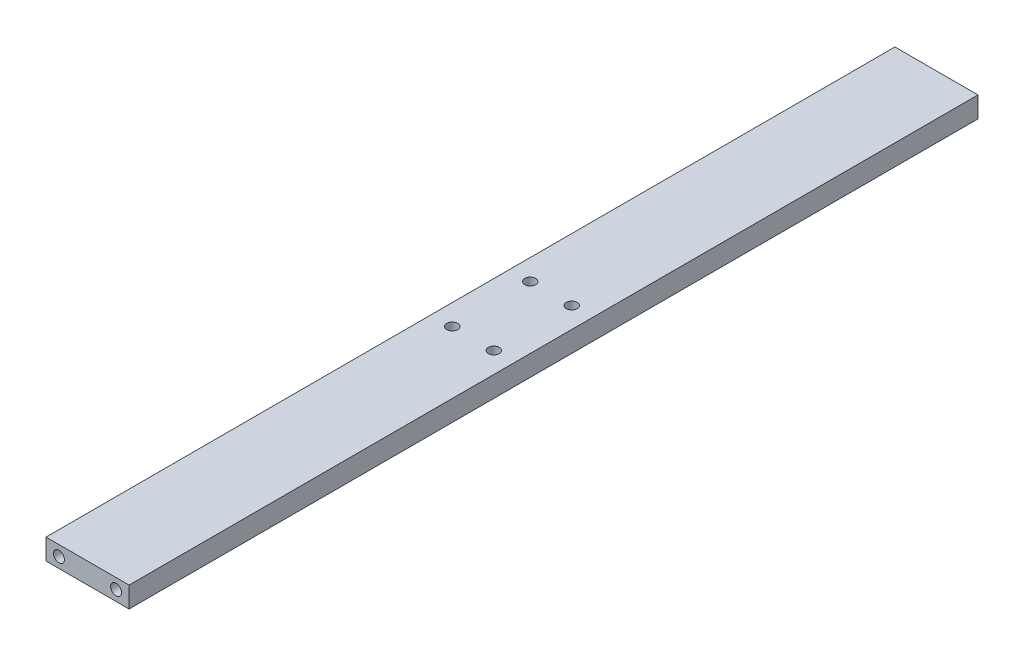
ISO-10303-21;
HEADER;
FILE_DESCRIPTION(('STEP AP214'),'2;1');
FILE_NAME('part.step','',(''),(''),'','','');
FILE_SCHEMA(('AUTOMOTIVE_DESIGN { 1 0 10303 214 1 1 1 1 }'));
ENDSEC;
DATA;
#1=APPLICATION_CONTEXT('core data for automotive mechanical design processes');
#2=APPLICATION_PROTOCOL_DEFINITION('international standard','automotive_design',2000,#1);
#3=PRODUCT_CONTEXT('',#1,'mechanical');
#4=PRODUCT('Part','Part','',(#3));
#5=PRODUCT_RELATED_PRODUCT_CATEGORY('part','',(#4));
#6=PRODUCT_DEFINITION_FORMATION('','',#4);
#7=PRODUCT_DEFINITION_CONTEXT('part definition',#1,'design');
#8=PRODUCT_DEFINITION('design','',#6,#7);
#9=PRODUCT_DEFINITION_SHAPE('','',#8);
#10=(LENGTH_UNIT() NAMED_UNIT(*) SI_UNIT(.MILLI.,.METRE.));
#11=(NAMED_UNIT(*) PLANE_ANGLE_UNIT() SI_UNIT($,.RADIAN.));
#12=(NAMED_UNIT(*) SI_UNIT($,.STERADIAN.) SOLID_ANGLE_UNIT());
#13=UNCERTAINTY_MEASURE_WITH_UNIT(LENGTH_MEASURE(1.E-05),#10,'distance_accuracy_value','');
#14=(GEOMETRIC_REPRESENTATION_CONTEXT(3) GLOBAL_UNCERTAINTY_ASSIGNED_CONTEXT((#13)) GLOBAL_UNIT_ASSIGNED_CONTEXT((#10,
#11,#12)) REPRESENTATION_CONTEXT('',''));
#15=CARTESIAN_POINT('',(0.,0.,0.));
#16=DIRECTION('',(0.,0.,1.));
#17=DIRECTION('',(1.,0.,0.));
#18=AXIS2_PLACEMENT_3D('',#15,#16,#17);
#19=CARTESIAN_POINT('',(-16.,-4.,163.5));
#20=DIRECTION('',(1.,0.,0.));
#21=DIRECTION('',(0.,0.,-1.));
#22=AXIS2_PLACEMENT_3D('',#19,#20,#21);
#23=PLANE('',#22);
#24=DIRECTION('',(0.,-1.,0.));
#25=VECTOR('',#24,1.);
#26=CARTESIAN_POINT('',(-16.,-4.,-163.5));
#27=LINE('',#26,#25);
#28=CARTESIAN_POINT('',(-16.,4.,-163.5));
#29=VERTEX_POINT('',#28);
#30=CARTESIAN_POINT('',(-16.,-4.,-163.5));
#31=VERTEX_POINT('',#30);
#32=EDGE_CURVE('E97',#29,#31,#27,.T.);
#33=ORIENTED_EDGE('',*,*,#32,.T.);
#34=DIRECTION('',(0.,0.,-1.));
#35=VECTOR('',#34,1.);
#36=CARTESIAN_POINT('',(-16.,-4.,163.5));
#37=LINE('',#36,#35);
#38=CARTESIAN_POINT('',(-16.,-4.,163.5));
#39=VERTEX_POINT('',#38);
#40=EDGE_CURVE('E11',#39,#31,#37,.T.);
#41=ORIENTED_EDGE('',*,*,#40,.F.);
#42=DIRECTION('',(0.,-1.,0.));
#43=VECTOR('',#42,1.);
#44=CARTESIAN_POINT('',(-16.,-4.,163.5));
#45=LINE('',#44,#43);
#46=CARTESIAN_POINT('',(-16.,4.,163.5));
#47=VERTEX_POINT('',#46);
#48=EDGE_CURVE('E85',#47,#39,#45,.T.);
#49=ORIENTED_EDGE('',*,*,#48,.F.);
#50=DIRECTION('',(0.,0.,-1.));
#51=VECTOR('',#50,1.);
#52=CARTESIAN_POINT('',(-16.,4.,163.5));
#53=LINE('',#52,#51);
#54=EDGE_CURVE('E93',#47,#29,#53,.T.);
#55=ORIENTED_EDGE('',*,*,#54,.T.);
#56=EDGE_LOOP('',(#33,#41,#49,#55));
#57=FACE_BOUND('',#56,.T.);
#58=ADVANCED_FACE('F34',(#57),#23,.F.);
#59=CARTESIAN_POINT('',(16.,-4.,163.5));
#60=DIRECTION('',(0.,1.,0.));
#61=DIRECTION('',(-1.,0.,0.));
#62=AXIS2_PLACEMENT_3D('',#59,#60,#61);
#63=PLANE('',#62);
#64=CARTESIAN_POINT('',(-7.99999999999912,-4.,-15.0000000000006));
#65=DIRECTION('',(0.,1.,0.));
#66=DIRECTION('',(-1.,0.,0.));
#67=AXIS2_PLACEMENT_3D('',#64,#65,#66);
#68=CIRCLE('',#67,2.10000000000043);
#69=CARTESIAN_POINT('',(-10.0999999999996,-4.,-15.0000000000006));
#70=VERTEX_POINT('',#69);
#71=EDGE_CURVE('E140',#70,#70,#68,.F.);
#72=ORIENTED_EDGE('',*,*,#71,.F.);
#73=EDGE_LOOP('',(#72));
#74=FACE_BOUND('',#73,.T.);
#75=CARTESIAN_POINT('',(8.00000000000001,-4.,15.0000000000001));
#76=DIRECTION('',(0.,1.,0.));
#77=DIRECTION('',(-1.,0.,0.));
#78=AXIS2_PLACEMENT_3D('',#75,#76,#77);
#79=CIRCLE('',#78,2.10000000000043);
#80=CARTESIAN_POINT('',(5.89999999999957,-4.,15.0000000000001));
#81=VERTEX_POINT('',#80);
#82=EDGE_CURVE('E141',#81,#81,#79,.F.);
#83=ORIENTED_EDGE('',*,*,#82,.F.);
#84=EDGE_LOOP('',(#83));
#85=FACE_BOUND('',#84,.T.);
#86=CARTESIAN_POINT('',(8.0000000000009,-4.,-15.0000000000006));
#87=DIRECTION('',(0.,1.,0.));
#88=DIRECTION('',(-1.,0.,0.));
#89=AXIS2_PLACEMENT_3D('',#86,#87,#88);
#90=CIRCLE('',#89,2.10000000000043);
#91=CARTESIAN_POINT('',(5.90000000000046,-4.,-15.0000000000006));
#92=VERTEX_POINT('',#91);
#93=EDGE_CURVE('E148',#92,#92,#90,.F.);
#94=ORIENTED_EDGE('',*,*,#93,.F.);
#95=EDGE_LOOP('',(#94));
#96=FACE_BOUND('',#95,.T.);
#97=CARTESIAN_POINT('',(-8.00000000000001,-4.,15.0000000000001));
#98=DIRECTION('',(0.,1.,0.));
#99=DIRECTION('',(-1.,0.,0.));
#100=AXIS2_PLACEMENT_3D('',#97,#98,#99);
#101=CIRCLE('',#100,2.10000000000043);
#102=CARTESIAN_POINT('',(-10.1000000000004,-4.,15.0000000000001));
#103=VERTEX_POINT('',#102);
#104=EDGE_CURVE('E127',#103,#103,#101,.F.);
#105=ORIENTED_EDGE('',*,*,#104,.F.);
#106=EDGE_LOOP('',(#105));
#107=FACE_BOUND('',#106,.T.);
#108=DIRECTION('',(1.,0.,0.));
#109=VECTOR('',#108,1.);
#110=CARTESIAN_POINT('',(16.,-4.,-163.5));
#111=LINE('',#110,#109);
#112=CARTESIAN_POINT('',(16.,-4.,-163.5));
#113=VERTEX_POINT('',#112);
#114=EDGE_CURVE('E89',#31,#113,#111,.T.);
#115=ORIENTED_EDGE('',*,*,#114,.T.);
#116=DIRECTION('',(0.,0.,-1.));
#117=VECTOR('',#116,1.);
#118=CARTESIAN_POINT('',(16.,-4.,163.5));
#119=LINE('',#118,#117);
#120=CARTESIAN_POINT('',(16.,-4.,163.5));
#121=VERTEX_POINT('',#120);
#122=EDGE_CURVE('E42',#121,#113,#119,.T.);
#123=ORIENTED_EDGE('',*,*,#122,.F.);
#124=DIRECTION('',(1.,0.,0.));
#125=VECTOR('',#124,1.);
#126=CARTESIAN_POINT('',(16.,-4.,163.5));
#127=LINE('',#126,#125);
#128=EDGE_CURVE('E80',#39,#121,#127,.T.);
#129=ORIENTED_EDGE('',*,*,#128,.F.);
#130=ORIENTED_EDGE('',*,*,#40,.T.);
#131=EDGE_LOOP('',(#115,#123,#129,#130));
#132=FACE_BOUND('',#131,.T.);
#133=ADVANCED_FACE('F88',(#74,#85,#96,#107,#132),#63,.F.);
#134=CARTESIAN_POINT('',(16.,-4.,163.5));
#135=DIRECTION('',(-1.,0.,0.));
#136=DIRECTION('',(0.,0.,1.));
#137=AXIS2_PLACEMENT_3D('',#134,#135,#136);
#138=PLANE('',#137);
#139=DIRECTION('',(0.,1.,0.));
#140=VECTOR('',#139,1.);
#141=CARTESIAN_POINT('',(16.,-4.,-163.5));
#142=LINE('',#141,#140);
#143=CARTESIAN_POINT('',(16.,4.,-163.5));
#144=VERTEX_POINT('',#143);
#145=EDGE_CURVE('E67',#113,#144,#142,.T.);
#146=ORIENTED_EDGE('',*,*,#145,.T.);
#147=DIRECTION('',(0.,0.,-1.));
#148=VECTOR('',#147,1.);
#149=CARTESIAN_POINT('',(16.,4.,163.5));
#150=LINE('',#149,#148);
#151=CARTESIAN_POINT('',(16.,4.,163.5));
#152=VERTEX_POINT('',#151);
#153=EDGE_CURVE('E90',#152,#144,#150,.T.);
#154=ORIENTED_EDGE('',*,*,#153,.F.);
#155=DIRECTION('',(0.,1.,0.));
#156=VECTOR('',#155,1.);
#157=CARTESIAN_POINT('',(16.,-4.,163.5));
#158=LINE('',#157,#156);
#159=EDGE_CURVE('E83',#121,#152,#158,.T.);
#160=ORIENTED_EDGE('',*,*,#159,.F.);
#161=ORIENTED_EDGE('',*,*,#122,.T.);
#162=EDGE_LOOP('',(#146,#154,#160,#161));
#163=FACE_BOUND('',#162,.T.);
#164=ADVANCED_FACE('F91',(#163),#138,.F.);
#165=CARTESIAN_POINT('',(16.,4.,163.5));
#166=DIRECTION('',(0.,-1.,0.));
#167=DIRECTION('',(1.,0.,0.));
#168=AXIS2_PLACEMENT_3D('',#165,#166,#167);
#169=PLANE('',#168);
#170=CARTESIAN_POINT('',(-7.99999999999912,4.,-15.0000000000006));
#171=DIRECTION('',(0.,1.,0.));
#172=DIRECTION('',(-1.,0.,0.));
#173=AXIS2_PLACEMENT_3D('',#170,#171,#172);
#174=CIRCLE('',#173,2.10000000000043);
#175=CARTESIAN_POINT('',(-10.0999999999996,4.,-15.0000000000006));
#176=VERTEX_POINT('',#175);
#177=EDGE_CURVE('E144',#176,#176,#174,.T.);
#178=ORIENTED_EDGE('',*,*,#177,.F.);
#179=EDGE_LOOP('',(#178));
#180=FACE_BOUND('',#179,.T.);
#181=CARTESIAN_POINT('',(8.00000000000001,4.,15.0000000000001));
#182=DIRECTION('',(0.,1.,0.));
#183=DIRECTION('',(-1.,0.,0.));
#184=AXIS2_PLACEMENT_3D('',#181,#182,#183);
#185=CIRCLE('',#184,2.10000000000043);
#186=CARTESIAN_POINT('',(5.89999999999957,4.,15.0000000000001));
#187=VERTEX_POINT('',#186);
#188=EDGE_CURVE('E145',#187,#187,#185,.T.);
#189=ORIENTED_EDGE('',*,*,#188,.F.);
#190=EDGE_LOOP('',(#189));
#191=FACE_BOUND('',#190,.T.);
#192=CARTESIAN_POINT('',(8.0000000000009,4.,-15.0000000000006));
#193=DIRECTION('',(0.,1.,0.));
#194=DIRECTION('',(-1.,0.,0.));
#195=AXIS2_PLACEMENT_3D('',#192,#193,#194);
#196=CIRCLE('',#195,2.10000000000043);
#197=CARTESIAN_POINT('',(5.90000000000046,4.,-15.0000000000006));
#198=VERTEX_POINT('',#197);
#199=EDGE_CURVE('E155',#198,#198,#196,.T.);
#200=ORIENTED_EDGE('',*,*,#199,.F.);
#201=EDGE_LOOP('',(#200));
#202=FACE_BOUND('',#201,.T.);
#203=CARTESIAN_POINT('',(-8.00000000000001,4.,15.0000000000001));
#204=DIRECTION('',(0.,1.,0.));
#205=DIRECTION('',(-1.,0.,0.));
#206=AXIS2_PLACEMENT_3D('',#203,#204,#205);
#207=CIRCLE('',#206,2.10000000000043);
#208=CARTESIAN_POINT('',(-10.1000000000004,4.,15.0000000000001));
#209=VERTEX_POINT('',#208);
#210=EDGE_CURVE('E137',#209,#209,#207,.T.);
#211=ORIENTED_EDGE('',*,*,#210,.F.);
#212=EDGE_LOOP('',(#211));
#213=FACE_BOUND('',#212,.T.);
#214=DIRECTION('',(-1.,0.,0.));
#215=VECTOR('',#214,1.);
#216=CARTESIAN_POINT('',(16.,4.,-163.5));
#217=LINE('',#216,#215);
#218=EDGE_CURVE('E73',#144,#29,#217,.T.);
#219=ORIENTED_EDGE('',*,*,#218,.T.);
#220=ORIENTED_EDGE('',*,*,#54,.F.);
#221=DIRECTION('',(-1.,0.,0.));
#222=VECTOR('',#221,1.);
#223=CARTESIAN_POINT('',(16.,4.,163.5));
#224=LINE('',#223,#222);
#225=EDGE_CURVE('E50',#152,#47,#224,.T.);
#226=ORIENTED_EDGE('',*,*,#225,.F.);
#227=ORIENTED_EDGE('',*,*,#153,.T.);
#228=EDGE_LOOP('',(#219,#220,#226,#227));
#229=FACE_BOUND('',#228,.T.);
#230=ADVANCED_FACE('F105',(#180,#191,#202,#213,#229),#169,.F.);
#231=CARTESIAN_POINT('',(0.,0.,163.5));
#232=DIRECTION('',(0.,0.,1.));
#233=DIRECTION('',(1.,0.,0.));
#234=AXIS2_PLACEMENT_3D('',#231,#232,#233);
#235=PLANE('',#234);
#236=CARTESIAN_POINT('',(-11.0000000000001,0.,163.5));
#237=DIRECTION('',(0.,0.,1.));
#238=DIRECTION('',(1.,0.,0.));
#239=AXIS2_PLACEMENT_3D('',#236,#237,#238);
#240=CIRCLE('',#239,2.1);
#241=CARTESIAN_POINT('',(-8.90000000000012,0.,163.5));
#242=VERTEX_POINT('',#241);
#243=EDGE_CURVE('E118',#242,#242,#240,.T.);
#244=ORIENTED_EDGE('',*,*,#243,.F.);
#245=EDGE_LOOP('',(#244));
#246=FACE_BOUND('',#245,.T.);
#247=CARTESIAN_POINT('',(11.0000000000001,0.,163.5));
#248=DIRECTION('',(0.,0.,1.));
#249=DIRECTION('',(1.,0.,0.));
#250=AXIS2_PLACEMENT_3D('',#247,#248,#249);
#251=CIRCLE('',#250,2.1);
#252=CARTESIAN_POINT('',(13.1000000000001,0.,163.5));
#253=VERTEX_POINT('',#252);
#254=EDGE_CURVE('E111',#253,#253,#251,.T.);
#255=ORIENTED_EDGE('',*,*,#254,.F.);
#256=EDGE_LOOP('',(#255));
#257=FACE_BOUND('',#256,.T.);
#258=ORIENTED_EDGE('',*,*,#48,.T.);
#259=ORIENTED_EDGE('',*,*,#128,.T.);
#260=ORIENTED_EDGE('',*,*,#159,.T.);
#261=ORIENTED_EDGE('',*,*,#225,.T.);
#262=EDGE_LOOP('',(#258,#259,#260,#261));
#263=FACE_BOUND('',#262,.T.);
#264=ADVANCED_FACE('F81',(#246,#257,#263),#235,.T.);
#265=CARTESIAN_POINT('',(0.,0.,-163.5));
#266=DIRECTION('',(0.,0.,1.));
#267=DIRECTION('',(1.,0.,0.));
#268=AXIS2_PLACEMENT_3D('',#265,#266,#267);
#269=PLANE('',#268);
#270=CARTESIAN_POINT('',(-11.0000000000001,0.,-163.5));
#271=DIRECTION('',(0.,0.,1.));
#272=DIRECTION('',(1.,0.,0.));
#273=AXIS2_PLACEMENT_3D('',#270,#271,#272);
#274=CIRCLE('',#273,2.1);
#275=CARTESIAN_POINT('',(-8.90000000000012,0.,-163.5));
#276=VERTEX_POINT('',#275);
#277=EDGE_CURVE('E130',#276,#276,#274,.T.);
#278=ORIENTED_EDGE('',*,*,#277,.T.);
#279=EDGE_LOOP('',(#278));
#280=FACE_BOUND('',#279,.T.);
#281=CARTESIAN_POINT('',(11.0000000000001,0.,-163.5));
#282=DIRECTION('',(0.,0.,1.));
#283=DIRECTION('',(1.,0.,0.));
#284=AXIS2_PLACEMENT_3D('',#281,#282,#283);
#285=CIRCLE('',#284,2.1);
#286=CARTESIAN_POINT('',(13.1000000000001,0.,-163.5));
#287=VERTEX_POINT('',#286);
#288=EDGE_CURVE('E123',#287,#287,#285,.T.);
#289=ORIENTED_EDGE('',*,*,#288,.T.);
#290=EDGE_LOOP('',(#289));
#291=FACE_BOUND('',#290,.T.);
#292=ORIENTED_EDGE('',*,*,#32,.F.);
#293=ORIENTED_EDGE('',*,*,#218,.F.);
#294=ORIENTED_EDGE('',*,*,#145,.F.);
#295=ORIENTED_EDGE('',*,*,#114,.F.);
#296=EDGE_LOOP('',(#292,#293,#294,#295));
#297=FACE_BOUND('',#296,.T.);
#298=ADVANCED_FACE('F108',(#280,#291,#297),#269,.F.);
#299=CARTESIAN_POINT('',(11.0000000000001,0.,153.5));
#300=DIRECTION('',(0.,0.,1.));
#301=DIRECTION('',(1.,0.,0.));
#302=AXIS2_PLACEMENT_3D('',#299,#300,#301);
#303=CYLINDRICAL_SURFACE('',#302,2.1);
#304=CARTESIAN_POINT('',(11.0000000000001,0.,153.5));
#305=DIRECTION('',(0.,0.,1.));
#306=DIRECTION('',(1.,0.,0.));
#307=AXIS2_PLACEMENT_3D('',#304,#305,#306);
#308=CIRCLE('',#307,2.1);
#309=CARTESIAN_POINT('',(13.1000000000001,0.,153.5));
#310=VERTEX_POINT('',#309);
#311=EDGE_CURVE('E114',#310,#310,#308,.T.);
#312=ORIENTED_EDGE('',*,*,#311,.F.);
#313=EDGE_LOOP('',(#312));
#314=FACE_BOUND('',#313,.T.);
#315=ORIENTED_EDGE('',*,*,#254,.T.);
#316=EDGE_LOOP('',(#315));
#317=FACE_BOUND('',#316,.T.);
#318=ADVANCED_FACE('F187',(#314,#317),#303,.F.);
#319=CARTESIAN_POINT('',(11.0000000000001,0.,153.5));
#320=DIRECTION('',(0.,0.,1.));
#321=DIRECTION('',(1.,0.,0.));
#322=AXIS2_PLACEMENT_3D('',#319,#320,#321);
#323=PLANE('',#322);
#324=ORIENTED_EDGE('',*,*,#311,.T.);
#325=EDGE_LOOP('',(#324));
#326=FACE_BOUND('',#325,.T.);
#327=ADVANCED_FACE('F194',(#326),#323,.T.);
#328=CARTESIAN_POINT('',(-11.0000000000001,0.,153.5));
#329=DIRECTION('',(0.,0.,1.));
#330=DIRECTION('',(1.,0.,0.));
#331=AXIS2_PLACEMENT_3D('',#328,#329,#330);
#332=CYLINDRICAL_SURFACE('',#331,2.1);
#333=CARTESIAN_POINT('',(-11.0000000000001,0.,153.5));
#334=DIRECTION('',(0.,0.,1.));
#335=DIRECTION('',(1.,0.,0.));
#336=AXIS2_PLACEMENT_3D('',#333,#334,#335);
#337=CIRCLE('',#336,2.1);
#338=CARTESIAN_POINT('',(-8.90000000000012,0.,153.5));
#339=VERTEX_POINT('',#338);
#340=EDGE_CURVE('E100',#339,#339,#337,.T.);
#341=ORIENTED_EDGE('',*,*,#340,.F.);
#342=EDGE_LOOP('',(#341));
#343=FACE_BOUND('',#342,.T.);
#344=ORIENTED_EDGE('',*,*,#243,.T.);
#345=EDGE_LOOP('',(#344));
#346=FACE_BOUND('',#345,.T.);
#347=ADVANCED_FACE('F198',(#343,#346),#332,.F.);
#348=CARTESIAN_POINT('',(-11.0000000000001,0.,153.5));
#349=DIRECTION('',(0.,0.,1.));
#350=DIRECTION('',(1.,0.,0.));
#351=AXIS2_PLACEMENT_3D('',#348,#349,#350);
#352=PLANE('',#351);
#353=ORIENTED_EDGE('',*,*,#340,.T.);
#354=EDGE_LOOP('',(#353));
#355=FACE_BOUND('',#354,.T.);
#356=ADVANCED_FACE('F202',(#355),#352,.T.);
#357=CARTESIAN_POINT('',(11.0000000000001,0.,-153.5));
#358=DIRECTION('',(0.,0.,-1.));
#359=DIRECTION('',(-1.,0.,0.));
#360=AXIS2_PLACEMENT_3D('',#357,#358,#359);
#361=CYLINDRICAL_SURFACE('',#360,2.1);
#362=CARTESIAN_POINT('',(11.0000000000001,0.,-153.5));
#363=DIRECTION('',(0.,0.,1.));
#364=DIRECTION('',(1.,0.,0.));
#365=AXIS2_PLACEMENT_3D('',#362,#363,#364);
#366=CIRCLE('',#365,2.1);
#367=CARTESIAN_POINT('',(13.1000000000001,0.,-153.5));
#368=VERTEX_POINT('',#367);
#369=EDGE_CURVE('E126',#368,#368,#366,.T.);
#370=ORIENTED_EDGE('',*,*,#369,.T.);
#371=EDGE_LOOP('',(#370));
#372=FACE_BOUND('',#371,.T.);
#373=ORIENTED_EDGE('',*,*,#288,.F.);
#374=EDGE_LOOP('',(#373));
#375=FACE_BOUND('',#374,.T.);
#376=ADVANCED_FACE('F206',(#372,#375),#361,.F.);
#377=CARTESIAN_POINT('',(11.0000000000001,0.,-153.5));
#378=DIRECTION('',(0.,0.,-1.));
#379=DIRECTION('',(1.,0.,0.));
#380=AXIS2_PLACEMENT_3D('',#377,#378,#379);
#381=PLANE('',#380);
#382=ORIENTED_EDGE('',*,*,#369,.F.);
#383=EDGE_LOOP('',(#382));
#384=FACE_BOUND('',#383,.T.);
#385=ADVANCED_FACE('F210',(#384),#381,.T.);
#386=CARTESIAN_POINT('',(-11.0000000000001,0.,-153.5));
#387=DIRECTION('',(0.,0.,-1.));
#388=DIRECTION('',(-1.,0.,0.));
#389=AXIS2_PLACEMENT_3D('',#386,#387,#388);
#390=CYLINDRICAL_SURFACE('',#389,2.1);
#391=CARTESIAN_POINT('',(-11.0000000000001,0.,-153.5));
#392=DIRECTION('',(0.,0.,1.));
#393=DIRECTION('',(1.,0.,0.));
#394=AXIS2_PLACEMENT_3D('',#391,#392,#393);
#395=CIRCLE('',#394,2.1);
#396=CARTESIAN_POINT('',(-8.90000000000012,0.,-153.5));
#397=VERTEX_POINT('',#396);
#398=EDGE_CURVE('E115',#397,#397,#395,.T.);
#399=ORIENTED_EDGE('',*,*,#398,.T.);
#400=EDGE_LOOP('',(#399));
#401=FACE_BOUND('',#400,.T.);
#402=ORIENTED_EDGE('',*,*,#277,.F.);
#403=EDGE_LOOP('',(#402));
#404=FACE_BOUND('',#403,.T.);
#405=ADVANCED_FACE('F214',(#401,#404),#390,.F.);
#406=CARTESIAN_POINT('',(-11.0000000000001,0.,-153.5));
#407=DIRECTION('',(0.,0.,-1.));
#408=DIRECTION('',(1.,0.,0.));
#409=AXIS2_PLACEMENT_3D('',#406,#407,#408);
#410=PLANE('',#409);
#411=ORIENTED_EDGE('',*,*,#398,.F.);
#412=EDGE_LOOP('',(#411));
#413=FACE_BOUND('',#412,.T.);
#414=ADVANCED_FACE('F171',(#413),#410,.T.);
#415=CARTESIAN_POINT('',(-8.00000000000001,-4.00100000000001,15.0000000000001));
#416=DIRECTION('',(0.,1.,0.));
#417=DIRECTION('',(-1.,0.,0.));
#418=AXIS2_PLACEMENT_3D('',#415,#416,#417);
#419=CYLINDRICAL_SURFACE('',#418,2.10000000000043);
#420=ORIENTED_EDGE('',*,*,#210,.T.);
#421=EDGE_LOOP('',(#420));
#422=FACE_BOUND('',#421,.T.);
#423=ORIENTED_EDGE('',*,*,#104,.T.);
#424=EDGE_LOOP('',(#423));
#425=FACE_BOUND('',#424,.T.);
#426=ADVANCED_FACE('F168',(#422,#425),#419,.F.);
#427=CARTESIAN_POINT('',(8.0000000000009,-4.001,-15.0000000000006));
#428=DIRECTION('',(0.,1.,0.));
#429=DIRECTION('',(-1.,0.,0.));
#430=AXIS2_PLACEMENT_3D('',#427,#428,#429);
#431=CYLINDRICAL_SURFACE('',#430,2.10000000000043);
#432=ORIENTED_EDGE('',*,*,#199,.T.);
#433=EDGE_LOOP('',(#432));
#434=FACE_BOUND('',#433,.T.);
#435=ORIENTED_EDGE('',*,*,#93,.T.);
#436=EDGE_LOOP('',(#435));
#437=FACE_BOUND('',#436,.T.);
#438=ADVANCED_FACE('F159',(#434,#437),#431,.F.);
#439=CARTESIAN_POINT('',(8.00000000000001,-4.001,15.0000000000001));
#440=DIRECTION('',(0.,1.,0.));
#441=DIRECTION('',(-1.,0.,0.));
#442=AXIS2_PLACEMENT_3D('',#439,#440,#441);
#443=CYLINDRICAL_SURFACE('',#442,2.10000000000043);
#444=ORIENTED_EDGE('',*,*,#188,.T.);
#445=EDGE_LOOP('',(#444));
#446=FACE_BOUND('',#445,.T.);
#447=ORIENTED_EDGE('',*,*,#82,.T.);
#448=EDGE_LOOP('',(#447));
#449=FACE_BOUND('',#448,.T.);
#450=ADVANCED_FACE('F222',(#446,#449),#443,.F.);
#451=CARTESIAN_POINT('',(-7.99999999999912,-4.00100000000001,-15.0000000000006));
#452=DIRECTION('',(0.,1.,0.));
#453=DIRECTION('',(-1.,0.,0.));
#454=AXIS2_PLACEMENT_3D('',#451,#452,#453);
#455=CYLINDRICAL_SURFACE('',#454,2.10000000000043);
#456=ORIENTED_EDGE('',*,*,#177,.T.);
#457=EDGE_LOOP('',(#456));
#458=FACE_BOUND('',#457,.T.);
#459=ORIENTED_EDGE('',*,*,#71,.T.);
#460=EDGE_LOOP('',(#459));
#461=FACE_BOUND('',#460,.T.);
#462=ADVANCED_FACE('F225',(#458,#461),#455,.F.);
#463=CLOSED_SHELL('',(#58,#133,#164,#230,#264,#298,#318,#327,#347,#356,#376,#385,#405,#414,#426,
#438,#450,#462));
#464=MANIFOLD_SOLID_BREP('B2',#463);
#465=ADVANCED_BREP_SHAPE_REPRESENTATION('',(#18,#464),#14);
#466=SHAPE_DEFINITION_REPRESENTATION(#9,#465);
ENDSEC;
END-ISO-10303-21;
